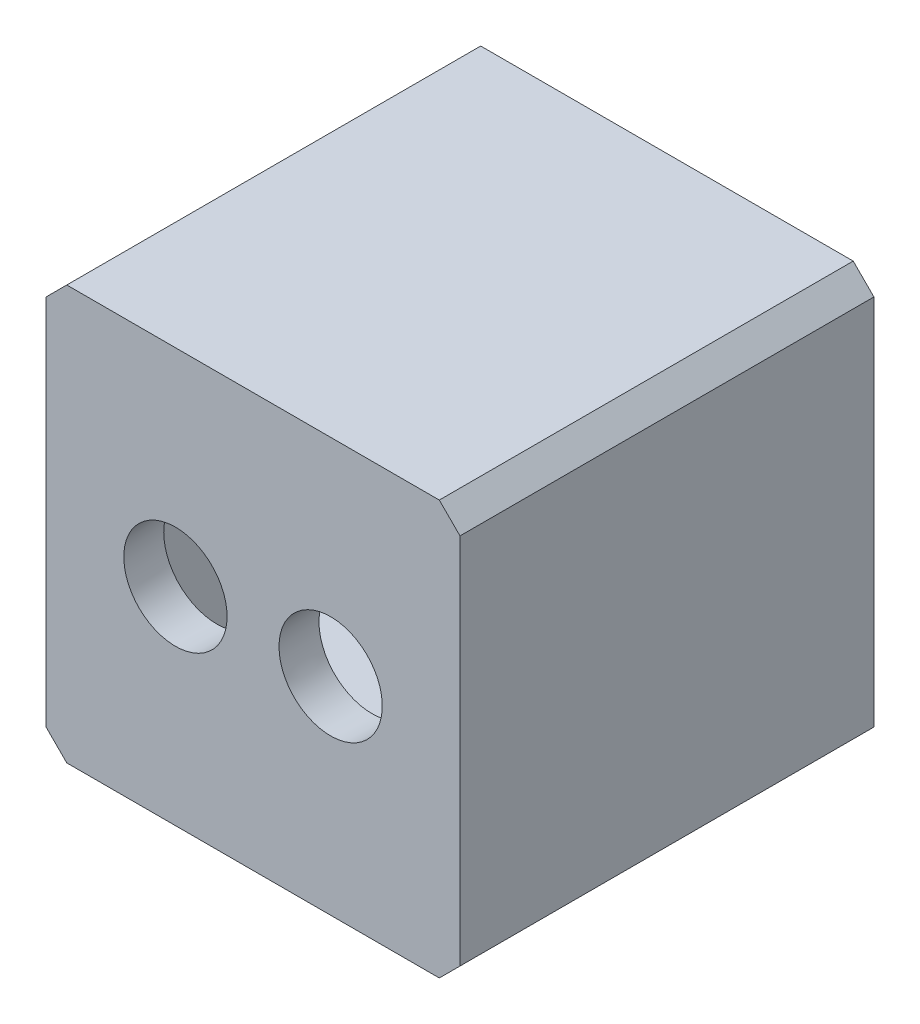
ISO-10303-21;
HEADER;
FILE_DESCRIPTION(('STEP AP214'),'2;1');
FILE_NAME('part.step','',(''),(''),'','','');
FILE_SCHEMA(('AUTOMOTIVE_DESIGN { 1 0 10303 214 1 1 1 1 }'));
ENDSEC;
DATA;
#1=APPLICATION_CONTEXT('core data for automotive mechanical design processes');
#2=APPLICATION_PROTOCOL_DEFINITION('international standard','automotive_design',2000,#1);
#3=PRODUCT_CONTEXT('',#1,'mechanical');
#4=PRODUCT('Part','Part','',(#3));
#5=PRODUCT_RELATED_PRODUCT_CATEGORY('part','',(#4));
#6=PRODUCT_DEFINITION_FORMATION('','',#4);
#7=PRODUCT_DEFINITION_CONTEXT('part definition',#1,'design');
#8=PRODUCT_DEFINITION('design','',#6,#7);
#9=PRODUCT_DEFINITION_SHAPE('','',#8);
#10=(LENGTH_UNIT() NAMED_UNIT(*) SI_UNIT(.MILLI.,.METRE.));
#11=(NAMED_UNIT(*) PLANE_ANGLE_UNIT() SI_UNIT($,.RADIAN.));
#12=(NAMED_UNIT(*) SI_UNIT($,.STERADIAN.) SOLID_ANGLE_UNIT());
#13=UNCERTAINTY_MEASURE_WITH_UNIT(LENGTH_MEASURE(1.E-05),#10,'distance_accuracy_value','');
#14=(GEOMETRIC_REPRESENTATION_CONTEXT(3) GLOBAL_UNCERTAINTY_ASSIGNED_CONTEXT((#13)) GLOBAL_UNIT_ASSIGNED_CONTEXT((#10,
#11,#12)) REPRESENTATION_CONTEXT('',''));
#15=CARTESIAN_POINT('',(0.,0.,0.));
#16=DIRECTION('',(0.,0.,1.));
#17=DIRECTION('',(1.,0.,0.));
#18=AXIS2_PLACEMENT_3D('',#15,#16,#17);
#19=CARTESIAN_POINT('',(-20.8804102547524,19.1826555023924,17.));
#20=DIRECTION('',(0.,0.,-1.));
#21=DIRECTION('',(-1.,0.,0.));
#22=AXIS2_PLACEMENT_3D('',#19,#20,#21);
#23=CONICAL_SURFACE('',#22,2.6,0.0349065850398866);
#24=CARTESIAN_POINT('',(-20.8804102547524,19.1826555023924,20.));
#25=DIRECTION('',(0.,0.,-1.));
#26=DIRECTION('',(-1.,0.,0.));
#27=AXIS2_PLACEMENT_3D('',#24,#25,#26);
#28=CIRCLE('',#27,2.49523769152476);
#29=CARTESIAN_POINT('',(-23.3756479462771,19.1826555023924,20.));
#30=VERTEX_POINT('',#29);
#31=EDGE_CURVE('E173',#30,#30,#28,.F.);
#32=ORIENTED_EDGE('',*,*,#31,.T.);
#33=EDGE_LOOP('',(#32));
#34=FACE_BOUND('',#33,.T.);
#35=CARTESIAN_POINT('',(-20.8804102547524,19.1826555023924,18.));
#36=DIRECTION('',(0.,0.,-1.));
#37=DIRECTION('',(-1.,0.,0.));
#38=AXIS2_PLACEMENT_3D('',#35,#36,#37);
#39=CIRCLE('',#38,2.56507923050826);
#40=CARTESIAN_POINT('',(-23.4454894852606,19.1826555023924,18.));
#41=VERTEX_POINT('',#40);
#42=EDGE_CURVE('E170',#41,#41,#39,.T.);
#43=ORIENTED_EDGE('',*,*,#42,.T.);
#44=EDGE_LOOP('',(#43));
#45=FACE_BOUND('',#44,.T.);
#46=ADVANCED_FACE('F35',(#34,#45),#23,.F.);
#47=CARTESIAN_POINT('',(-28.3804102547524,19.1826555023924,17.));
#48=DIRECTION('',(0.,0.,-1.));
#49=DIRECTION('',(1.,0.,0.));
#50=AXIS2_PLACEMENT_3D('',#47,#48,#49);
#51=CONICAL_SURFACE('',#50,2.6,0.0349065850398866);
#52=CARTESIAN_POINT('',(-28.3804102547524,19.1826555023924,20.));
#53=DIRECTION('',(0.,0.,1.));
#54=DIRECTION('',(1.,0.,0.));
#55=AXIS2_PLACEMENT_3D('',#52,#53,#54);
#56=CIRCLE('',#55,2.49523769152476);
#57=CARTESIAN_POINT('',(-25.8851725632276,19.1826555023924,20.));
#58=VERTEX_POINT('',#57);
#59=EDGE_CURVE('E174',#58,#58,#56,.T.);
#60=ORIENTED_EDGE('',*,*,#59,.T.);
#61=EDGE_LOOP('',(#60));
#62=FACE_BOUND('',#61,.T.);
#63=CARTESIAN_POINT('',(-28.3804102547524,19.1826555023924,18.));
#64=DIRECTION('',(0.,0.,-1.));
#65=DIRECTION('',(-1.,0.,0.));
#66=AXIS2_PLACEMENT_3D('',#63,#64,#65);
#67=CIRCLE('',#66,2.56507923050825);
#68=CARTESIAN_POINT('',(-30.9454894852606,19.1826555023924,18.));
#69=VERTEX_POINT('',#68);
#70=EDGE_CURVE('E166',#69,#69,#67,.T.);
#71=ORIENTED_EDGE('',*,*,#70,.T.);
#72=EDGE_LOOP('',(#71));
#73=FACE_BOUND('',#72,.T.);
#74=ADVANCED_FACE('F272',(#62,#73),#51,.F.);
#75=CARTESIAN_POINT('',(-34.6304102547524,29.1826555023924,20.));
#76=DIRECTION('',(1.,0.,0.));
#77=DIRECTION('',(0.,1.,0.));
#78=AXIS2_PLACEMENT_3D('',#75,#76,#77);
#79=PLANE('',#78);
#80=DIRECTION('',(0.,-1.,0.));
#81=VECTOR('',#80,1.);
#82=CARTESIAN_POINT('',(-34.6304102547524,29.1826555023924,20.));
#83=LINE('',#82,#81);
#84=CARTESIAN_POINT('',(-34.6304102547524,28.1826555023924,20.));
#85=VERTEX_POINT('',#84);
#86=CARTESIAN_POINT('',(-34.6304102547524,10.1826555023923,20.));
#87=VERTEX_POINT('',#86);
#88=EDGE_CURVE('E180',#85,#87,#83,.T.);
#89=ORIENTED_EDGE('',*,*,#88,.F.);
#90=DIRECTION('',(0.,0.,-1.));
#91=VECTOR('',#90,1.);
#92=CARTESIAN_POINT('',(-34.6304102547524,28.1826555023924,20.));
#93=LINE('',#92,#91);
#94=CARTESIAN_POINT('',(-34.6304102547524,28.1826555023924,0.));
#95=VERTEX_POINT('',#94);
#96=EDGE_CURVE('E11',#85,#95,#93,.T.);
#97=ORIENTED_EDGE('',*,*,#96,.T.);
#98=DIRECTION('',(0.,-1.,0.));
#99=VECTOR('',#98,1.);
#100=CARTESIAN_POINT('',(-34.6304102547524,29.1826555023924,0.));
#101=LINE('',#100,#99);
#102=CARTESIAN_POINT('',(-34.6304102547524,10.1826555023923,0.));
#103=VERTEX_POINT('',#102);
#104=EDGE_CURVE('E177',#95,#103,#101,.T.);
#105=ORIENTED_EDGE('',*,*,#104,.T.);
#106=DIRECTION('',(0.,0.,1.));
#107=VECTOR('',#106,1.);
#108=CARTESIAN_POINT('',(-34.6304102547524,10.1826555023923,20.));
#109=LINE('',#108,#107);
#110=EDGE_CURVE('E44',#103,#87,#109,.T.);
#111=ORIENTED_EDGE('',*,*,#110,.T.);
#112=EDGE_LOOP('',(#89,#97,#105,#111));
#113=FACE_BOUND('',#112,.T.);
#114=ADVANCED_FACE('F233',(#113),#79,.F.);
#115=CARTESIAN_POINT('',(-34.6304102547524,9.18265550239235,20.));
#116=DIRECTION('',(0.,1.,0.));
#117=DIRECTION('',(-1.,0.,0.));
#118=AXIS2_PLACEMENT_3D('',#115,#116,#117);
#119=PLANE('',#118);
#120=DIRECTION('',(1.,0.,0.));
#121=VECTOR('',#120,1.);
#122=CARTESIAN_POINT('',(-34.6304102547524,9.18265550239235,0.));
#123=LINE('',#122,#121);
#124=CARTESIAN_POINT('',(-33.6304102547524,9.18265550239235,0.));
#125=VERTEX_POINT('',#124);
#126=CARTESIAN_POINT('',(-15.6304102547524,9.18265550239235,0.));
#127=VERTEX_POINT('',#126);
#128=EDGE_CURVE('E194',#125,#127,#123,.T.);
#129=ORIENTED_EDGE('',*,*,#128,.T.);
#130=DIRECTION('',(0.,0.,1.));
#131=VECTOR('',#130,1.);
#132=CARTESIAN_POINT('',(-15.6304102547524,9.18265550239235,20.));
#133=LINE('',#132,#131);
#134=CARTESIAN_POINT('',(-15.6304102547524,9.18265550239235,20.));
#135=VERTEX_POINT('',#134);
#136=EDGE_CURVE('E218',#127,#135,#133,.T.);
#137=ORIENTED_EDGE('',*,*,#136,.T.);
#138=DIRECTION('',(1.,0.,0.));
#139=VECTOR('',#138,1.);
#140=CARTESIAN_POINT('',(-34.6304102547524,9.18265550239235,20.));
#141=LINE('',#140,#139);
#142=CARTESIAN_POINT('',(-33.6304102547524,9.18265550239235,20.));
#143=VERTEX_POINT('',#142);
#144=EDGE_CURVE('E183',#143,#135,#141,.T.);
#145=ORIENTED_EDGE('',*,*,#144,.F.);
#146=DIRECTION('',(0.,0.,-1.));
#147=VECTOR('',#146,1.);
#148=CARTESIAN_POINT('',(-33.6304102547524,9.18265550239235,20.));
#149=LINE('',#148,#147);
#150=EDGE_CURVE('E215',#143,#125,#149,.T.);
#151=ORIENTED_EDGE('',*,*,#150,.T.);
#152=EDGE_LOOP('',(#129,#137,#145,#151));
#153=FACE_BOUND('',#152,.T.);
#154=ADVANCED_FACE('F244',(#153),#119,.F.);
#155=CARTESIAN_POINT('',(-14.6304102547524,29.1826555023924,20.));
#156=DIRECTION('',(-1.,0.,0.));
#157=DIRECTION('',(0.,-1.,0.));
#158=AXIS2_PLACEMENT_3D('',#155,#156,#157);
#159=PLANE('',#158);
#160=DIRECTION('',(0.,1.,0.));
#161=VECTOR('',#160,1.);
#162=CARTESIAN_POINT('',(-14.6304102547524,29.1826555023924,20.));
#163=LINE('',#162,#161);
#164=CARTESIAN_POINT('',(-14.6304102547524,10.1826555023924,20.));
#165=VERTEX_POINT('',#164);
#166=CARTESIAN_POINT('',(-14.6304102547524,28.1826555023923,20.));
#167=VERTEX_POINT('',#166);
#168=EDGE_CURVE('E187',#165,#167,#163,.T.);
#169=ORIENTED_EDGE('',*,*,#168,.F.);
#170=DIRECTION('',(0.,0.,-1.));
#171=VECTOR('',#170,1.);
#172=CARTESIAN_POINT('',(-14.6304102547524,10.1826555023924,20.));
#173=LINE('',#172,#171);
#174=CARTESIAN_POINT('',(-14.6304102547524,10.1826555023924,0.));
#175=VERTEX_POINT('',#174);
#176=EDGE_CURVE('E204',#165,#175,#173,.T.);
#177=ORIENTED_EDGE('',*,*,#176,.T.);
#178=DIRECTION('',(0.,1.,0.));
#179=VECTOR('',#178,1.);
#180=CARTESIAN_POINT('',(-14.6304102547524,29.1826555023924,0.));
#181=LINE('',#180,#179);
#182=CARTESIAN_POINT('',(-14.6304102547524,28.1826555023923,0.));
#183=VERTEX_POINT('',#182);
#184=EDGE_CURVE('E197',#175,#183,#181,.T.);
#185=ORIENTED_EDGE('',*,*,#184,.T.);
#186=DIRECTION('',(0.,0.,1.));
#187=VECTOR('',#186,1.);
#188=CARTESIAN_POINT('',(-14.6304102547524,28.1826555023923,20.));
#189=LINE('',#188,#187);
#190=EDGE_CURVE('E191',#183,#167,#189,.T.);
#191=ORIENTED_EDGE('',*,*,#190,.T.);
#192=EDGE_LOOP('',(#169,#177,#185,#191));
#193=FACE_BOUND('',#192,.T.);
#194=ADVANCED_FACE('F255',(#193),#159,.F.);
#195=CARTESIAN_POINT('',(-34.6304102547524,29.1826555023924,20.));
#196=DIRECTION('',(0.,-1.,0.));
#197=DIRECTION('',(0.,0.,-1.));
#198=AXIS2_PLACEMENT_3D('',#195,#196,#197);
#199=PLANE('',#198);
#200=DIRECTION('',(-1.,0.,0.));
#201=VECTOR('',#200,1.);
#202=CARTESIAN_POINT('',(-34.6304102547524,29.1826555023924,20.));
#203=LINE('',#202,#201);
#204=CARTESIAN_POINT('',(-15.6304102547524,29.1826555023924,20.));
#205=VERTEX_POINT('',#204);
#206=CARTESIAN_POINT('',(-33.6304102547524,29.1826555023924,20.));
#207=VERTEX_POINT('',#206);
#208=EDGE_CURVE('E189',#205,#207,#203,.T.);
#209=ORIENTED_EDGE('',*,*,#208,.F.);
#210=DIRECTION('',(0.,0.,-1.));
#211=VECTOR('',#210,1.);
#212=CARTESIAN_POINT('',(-15.6304102547524,29.1826555023924,20.));
#213=LINE('',#212,#211);
#214=CARTESIAN_POINT('',(-15.6304102547524,29.1826555023924,0.));
#215=VERTEX_POINT('',#214);
#216=EDGE_CURVE('E228',#205,#215,#213,.T.);
#217=ORIENTED_EDGE('',*,*,#216,.T.);
#218=DIRECTION('',(-1.,0.,0.));
#219=VECTOR('',#218,1.);
#220=CARTESIAN_POINT('',(-34.6304102547524,29.1826555023924,0.));
#221=LINE('',#220,#219);
#222=CARTESIAN_POINT('',(-33.6304102547524,29.1826555023924,0.));
#223=VERTEX_POINT('',#222);
#224=EDGE_CURVE('E184',#215,#223,#221,.T.);
#225=ORIENTED_EDGE('',*,*,#224,.T.);
#226=DIRECTION('',(0.,0.,1.));
#227=VECTOR('',#226,1.);
#228=CARTESIAN_POINT('',(-33.6304102547524,29.1826555023924,20.));
#229=LINE('',#228,#227);
#230=EDGE_CURVE('E51',#223,#207,#229,.T.);
#231=ORIENTED_EDGE('',*,*,#230,.T.);
#232=EDGE_LOOP('',(#209,#217,#225,#231));
#233=FACE_BOUND('',#232,.T.);
#234=ADVANCED_FACE('F261',(#233),#199,.F.);
#235=CARTESIAN_POINT('',(0.,0.,20.));
#236=DIRECTION('',(0.,0.,1.));
#237=DIRECTION('',(1.,0.,0.));
#238=AXIS2_PLACEMENT_3D('',#235,#236,#237);
#239=PLANE('',#238);
#240=ORIENTED_EDGE('',*,*,#59,.F.);
#241=EDGE_LOOP('',(#240));
#242=FACE_BOUND('',#241,.T.);
#243=ORIENTED_EDGE('',*,*,#31,.F.);
#244=EDGE_LOOP('',(#243));
#245=FACE_BOUND('',#244,.T.);
#246=ORIENTED_EDGE('',*,*,#144,.T.);
#247=DIRECTION('',(-0.707106781186549,-0.707106781186546,0.));
#248=VECTOR('',#247,1.);
#249=CARTESIAN_POINT('',(-12.4065328785723,12.4065328785724,20.));
#250=LINE('',#249,#248);
#251=EDGE_CURVE('E225',#135,#165,#250,.F.);
#252=ORIENTED_EDGE('',*,*,#251,.T.);
#253=ORIENTED_EDGE('',*,*,#168,.T.);
#254=DIRECTION('',(0.707106781186546,-0.707106781186549,0.));
#255=VECTOR('',#254,1.);
#256=CARTESIAN_POINT('',(6.77612262381995,6.77612262381993,20.));
#257=LINE('',#256,#255);
#258=EDGE_CURVE('E58',#167,#205,#257,.F.);
#259=ORIENTED_EDGE('',*,*,#258,.T.);
#260=ORIENTED_EDGE('',*,*,#208,.T.);
#261=DIRECTION('',(0.707106781186549,0.707106781186546,0.));
#262=VECTOR('',#261,1.);
#263=CARTESIAN_POINT('',(-31.4065328785723,31.4065328785724,20.));
#264=LINE('',#263,#262);
#265=EDGE_CURVE('E222',#207,#85,#264,.F.);
#266=ORIENTED_EDGE('',*,*,#265,.T.);
#267=ORIENTED_EDGE('',*,*,#88,.T.);
#268=DIRECTION('',(-0.707106781186548,0.707106781186548,0.));
#269=VECTOR('',#268,1.);
#270=CARTESIAN_POINT('',(-12.22387737618,-12.22387737618,20.));
#271=LINE('',#270,#269);
#272=EDGE_CURVE('E220',#87,#143,#271,.F.);
#273=ORIENTED_EDGE('',*,*,#272,.T.);
#274=EDGE_LOOP('',(#246,#252,#253,#259,#260,#266,#267,#273));
#275=FACE_BOUND('',#274,.T.);
#276=ADVANCED_FACE('F238',(#242,#245,#275),#239,.T.);
#277=CARTESIAN_POINT('',(0.,0.,0.));
#278=DIRECTION('',(0.,0.,1.));
#279=DIRECTION('',(1.,0.,0.));
#280=AXIS2_PLACEMENT_3D('',#277,#278,#279);
#281=PLANE('',#280);
#282=DIRECTION('',(-1.,0.,0.));
#283=VECTOR('',#282,1.);
#284=CARTESIAN_POINT('',(-16.6304102547524,11.1826555023924,0.));
#285=LINE('',#284,#283);
#286=CARTESIAN_POINT('',(-16.6304102547524,11.1826555023924,0.));
#287=VERTEX_POINT('',#286);
#288=CARTESIAN_POINT('',(-32.6304102547524,11.1826555023924,0.));
#289=VERTEX_POINT('',#288);
#290=EDGE_CURVE('E160',#287,#289,#285,.T.);
#291=ORIENTED_EDGE('',*,*,#290,.F.);
#292=DIRECTION('',(0.,-1.,0.));
#293=VECTOR('',#292,1.);
#294=CARTESIAN_POINT('',(-16.6304102547524,27.1826555023924,0.));
#295=LINE('',#294,#293);
#296=CARTESIAN_POINT('',(-16.6304102547524,27.1826555023924,0.));
#297=VERTEX_POINT('',#296);
#298=EDGE_CURVE('E134',#297,#287,#295,.T.);
#299=ORIENTED_EDGE('',*,*,#298,.F.);
#300=DIRECTION('',(1.,0.,0.));
#301=VECTOR('',#300,1.);
#302=CARTESIAN_POINT('',(-16.6304102547524,27.1826555023924,0.));
#303=LINE('',#302,#301);
#304=CARTESIAN_POINT('',(-32.6304102547524,27.1826555023924,0.));
#305=VERTEX_POINT('',#304);
#306=EDGE_CURVE('E151',#305,#297,#303,.T.);
#307=ORIENTED_EDGE('',*,*,#306,.F.);
#308=DIRECTION('',(0.,1.,0.));
#309=VECTOR('',#308,1.);
#310=CARTESIAN_POINT('',(-32.6304102547524,27.1826555023924,0.));
#311=LINE('',#310,#309);
#312=EDGE_CURVE('E154',#289,#305,#311,.T.);
#313=ORIENTED_EDGE('',*,*,#312,.F.);
#314=EDGE_LOOP('',(#291,#299,#307,#313));
#315=FACE_BOUND('',#314,.T.);
#316=ORIENTED_EDGE('',*,*,#184,.F.);
#317=DIRECTION('',(0.707106781186549,0.707106781186546,0.));
#318=VECTOR('',#317,1.);
#319=CARTESIAN_POINT('',(-14.6304102547524,10.1826555023924,0.));
#320=LINE('',#319,#318);
#321=EDGE_CURVE('E213',#175,#127,#320,.F.);
#322=ORIENTED_EDGE('',*,*,#321,.T.);
#323=ORIENTED_EDGE('',*,*,#128,.F.);
#324=DIRECTION('',(0.707106781186548,-0.707106781186548,0.));
#325=VECTOR('',#324,1.);
#326=CARTESIAN_POINT('',(-33.6304102547524,9.18265550239235,0.));
#327=LINE('',#326,#325);
#328=EDGE_CURVE('E207',#125,#103,#327,.F.);
#329=ORIENTED_EDGE('',*,*,#328,.T.);
#330=ORIENTED_EDGE('',*,*,#104,.F.);
#331=DIRECTION('',(-0.707106781186549,-0.707106781186546,0.));
#332=VECTOR('',#331,1.);
#333=CARTESIAN_POINT('',(-34.6304102547524,28.1826555023924,0.));
#334=LINE('',#333,#332);
#335=EDGE_CURVE('E209',#95,#223,#334,.F.);
#336=ORIENTED_EDGE('',*,*,#335,.T.);
#337=ORIENTED_EDGE('',*,*,#224,.F.);
#338=DIRECTION('',(-0.707106781186546,0.707106781186549,0.));
#339=VECTOR('',#338,1.);
#340=CARTESIAN_POINT('',(-15.6304102547524,29.1826555023924,0.));
#341=LINE('',#340,#339);
#342=EDGE_CURVE('E211',#215,#183,#341,.F.);
#343=ORIENTED_EDGE('',*,*,#342,.T.);
#344=EDGE_LOOP('',(#316,#322,#323,#329,#330,#336,#337,#343));
#345=FACE_BOUND('',#344,.T.);
#346=ADVANCED_FACE('F248',(#315,#345),#281,.F.);
#347=CARTESIAN_POINT('',(-16.6304102547524,27.1826555023924,18.));
#348=DIRECTION('',(1.,0.,0.));
#349=DIRECTION('',(0.,1.,0.));
#350=AXIS2_PLACEMENT_3D('',#347,#348,#349);
#351=PLANE('',#350);
#352=ORIENTED_EDGE('',*,*,#298,.T.);
#353=DIRECTION('',(0.,0.,-1.));
#354=VECTOR('',#353,1.);
#355=CARTESIAN_POINT('',(-16.6304102547524,11.1826555023924,18.));
#356=LINE('',#355,#354);
#357=CARTESIAN_POINT('',(-16.6304102547524,11.1826555023924,18.));
#358=VERTEX_POINT('',#357);
#359=EDGE_CURVE('E127',#358,#287,#356,.T.);
#360=ORIENTED_EDGE('',*,*,#359,.F.);
#361=DIRECTION('',(0.,-1.,0.));
#362=VECTOR('',#361,1.);
#363=CARTESIAN_POINT('',(-16.6304102547524,27.1826555023924,18.));
#364=LINE('',#363,#362);
#365=CARTESIAN_POINT('',(-16.6304102547524,27.1826555023924,18.));
#366=VERTEX_POINT('',#365);
#367=EDGE_CURVE('E131',#366,#358,#364,.T.);
#368=ORIENTED_EDGE('',*,*,#367,.F.);
#369=DIRECTION('',(0.,0.,-1.));
#370=VECTOR('',#369,1.);
#371=CARTESIAN_POINT('',(-16.6304102547524,27.1826555023924,18.));
#372=LINE('',#371,#370);
#373=EDGE_CURVE('E164',#366,#297,#372,.T.);
#374=ORIENTED_EDGE('',*,*,#373,.T.);
#375=EDGE_LOOP('',(#352,#360,#368,#374));
#376=FACE_BOUND('',#375,.T.);
#377=ADVANCED_FACE('F129',(#376),#351,.F.);
#378=CARTESIAN_POINT('',(-16.6304102547524,27.1826555023924,18.));
#379=DIRECTION('',(0.,1.,0.));
#380=DIRECTION('',(0.,0.,1.));
#381=AXIS2_PLACEMENT_3D('',#378,#379,#380);
#382=PLANE('',#381);
#383=ORIENTED_EDGE('',*,*,#306,.T.);
#384=ORIENTED_EDGE('',*,*,#373,.F.);
#385=DIRECTION('',(1.,0.,0.));
#386=VECTOR('',#385,1.);
#387=CARTESIAN_POINT('',(-16.6304102547524,27.1826555023924,18.));
#388=LINE('',#387,#386);
#389=CARTESIAN_POINT('',(-32.6304102547524,27.1826555023924,18.));
#390=VERTEX_POINT('',#389);
#391=EDGE_CURVE('E139',#390,#366,#388,.T.);
#392=ORIENTED_EDGE('',*,*,#391,.F.);
#393=DIRECTION('',(0.,0.,-1.));
#394=VECTOR('',#393,1.);
#395=CARTESIAN_POINT('',(-32.6304102547524,27.1826555023924,18.));
#396=LINE('',#395,#394);
#397=EDGE_CURVE('E167',#390,#305,#396,.T.);
#398=ORIENTED_EDGE('',*,*,#397,.T.);
#399=EDGE_LOOP('',(#383,#384,#392,#398));
#400=FACE_BOUND('',#399,.T.);
#401=ADVANCED_FACE('F321',(#400),#382,.F.);
#402=CARTESIAN_POINT('',(-32.6304102547524,27.1826555023924,18.));
#403=DIRECTION('',(-1.,0.,0.));
#404=DIRECTION('',(0.,0.,1.));
#405=AXIS2_PLACEMENT_3D('',#402,#403,#404);
#406=PLANE('',#405);
#407=ORIENTED_EDGE('',*,*,#312,.T.);
#408=ORIENTED_EDGE('',*,*,#397,.F.);
#409=DIRECTION('',(0.,1.,0.));
#410=VECTOR('',#409,1.);
#411=CARTESIAN_POINT('',(-32.6304102547524,27.1826555023924,18.));
#412=LINE('',#411,#410);
#413=CARTESIAN_POINT('',(-32.6304102547524,11.1826555023924,18.));
#414=VERTEX_POINT('',#413);
#415=EDGE_CURVE('E147',#414,#390,#412,.T.);
#416=ORIENTED_EDGE('',*,*,#415,.F.);
#417=DIRECTION('',(0.,0.,-1.));
#418=VECTOR('',#417,1.);
#419=CARTESIAN_POINT('',(-32.6304102547524,11.1826555023924,18.));
#420=LINE('',#419,#418);
#421=EDGE_CURVE('E138',#414,#289,#420,.T.);
#422=ORIENTED_EDGE('',*,*,#421,.T.);
#423=EDGE_LOOP('',(#407,#408,#416,#422));
#424=FACE_BOUND('',#423,.T.);
#425=ADVANCED_FACE('F316',(#424),#406,.F.);
#426=CARTESIAN_POINT('',(-16.6304102547524,11.1826555023924,18.));
#427=DIRECTION('',(0.,-1.,0.));
#428=DIRECTION('',(1.,0.,0.));
#429=AXIS2_PLACEMENT_3D('',#426,#427,#428);
#430=PLANE('',#429);
#431=ORIENTED_EDGE('',*,*,#290,.T.);
#432=ORIENTED_EDGE('',*,*,#421,.F.);
#433=DIRECTION('',(-1.,0.,0.));
#434=VECTOR('',#433,1.);
#435=CARTESIAN_POINT('',(-16.6304102547524,11.1826555023924,18.));
#436=LINE('',#435,#434);
#437=EDGE_CURVE('E142',#358,#414,#436,.T.);
#438=ORIENTED_EDGE('',*,*,#437,.F.);
#439=ORIENTED_EDGE('',*,*,#359,.T.);
#440=EDGE_LOOP('',(#431,#432,#438,#439));
#441=FACE_BOUND('',#440,.T.);
#442=ADVANCED_FACE('F143',(#441),#430,.F.);
#443=CARTESIAN_POINT('',(0.,0.,18.));
#444=DIRECTION('',(0.,0.,-1.));
#445=DIRECTION('',(-1.,0.,0.));
#446=AXIS2_PLACEMENT_3D('',#443,#444,#445);
#447=PLANE('',#446);
#448=ORIENTED_EDGE('',*,*,#42,.F.);
#449=EDGE_LOOP('',(#448));
#450=FACE_BOUND('',#449,.T.);
#451=ORIENTED_EDGE('',*,*,#70,.F.);
#452=EDGE_LOOP('',(#451));
#453=FACE_BOUND('',#452,.T.);
#454=ORIENTED_EDGE('',*,*,#367,.T.);
#455=ORIENTED_EDGE('',*,*,#437,.T.);
#456=ORIENTED_EDGE('',*,*,#415,.T.);
#457=ORIENTED_EDGE('',*,*,#391,.T.);
#458=EDGE_LOOP('',(#454,#455,#456,#457));
#459=FACE_BOUND('',#458,.T.);
#460=ADVANCED_FACE('F149',(#450,#453,#459),#447,.T.);
#461=CARTESIAN_POINT('',(-14.6304102547524,10.1826555023924,20.));
#462=DIRECTION('',(-0.707106781186546,0.707106781186549,0.));
#463=DIRECTION('',(0.,0.,-1.));
#464=AXIS2_PLACEMENT_3D('',#461,#462,#463);
#465=PLANE('',#464);
#466=ORIENTED_EDGE('',*,*,#251,.F.);
#467=ORIENTED_EDGE('',*,*,#136,.F.);
#468=ORIENTED_EDGE('',*,*,#321,.F.);
#469=ORIENTED_EDGE('',*,*,#176,.F.);
#470=EDGE_LOOP('',(#466,#467,#468,#469));
#471=FACE_BOUND('',#470,.T.);
#472=ADVANCED_FACE('F252',(#471),#465,.F.);
#473=CARTESIAN_POINT('',(-15.6304102547524,29.1826555023924,20.));
#474=DIRECTION('',(-0.707106781186549,-0.707106781186546,0.));
#475=DIRECTION('',(0.,0.,-1.));
#476=AXIS2_PLACEMENT_3D('',#473,#474,#475);
#477=PLANE('',#476);
#478=ORIENTED_EDGE('',*,*,#258,.F.);
#479=ORIENTED_EDGE('',*,*,#190,.F.);
#480=ORIENTED_EDGE('',*,*,#342,.F.);
#481=ORIENTED_EDGE('',*,*,#216,.F.);
#482=EDGE_LOOP('',(#478,#479,#480,#481));
#483=FACE_BOUND('',#482,.T.);
#484=ADVANCED_FACE('F259',(#483),#477,.F.);
#485=CARTESIAN_POINT('',(-34.6304102547524,28.1826555023924,20.));
#486=DIRECTION('',(0.707106781186546,-0.707106781186549,0.));
#487=DIRECTION('',(0.,0.,-1.));
#488=AXIS2_PLACEMENT_3D('',#485,#486,#487);
#489=PLANE('',#488);
#490=ORIENTED_EDGE('',*,*,#265,.F.);
#491=ORIENTED_EDGE('',*,*,#230,.F.);
#492=ORIENTED_EDGE('',*,*,#335,.F.);
#493=ORIENTED_EDGE('',*,*,#96,.F.);
#494=EDGE_LOOP('',(#490,#491,#492,#493));
#495=FACE_BOUND('',#494,.T.);
#496=ADVANCED_FACE('F263',(#495),#489,.F.);
#497=CARTESIAN_POINT('',(-33.6304102547524,9.18265550239235,20.));
#498=DIRECTION('',(0.707106781186547,0.707106781186547,0.));
#499=DIRECTION('',(0.,0.,-1.));
#500=AXIS2_PLACEMENT_3D('',#497,#498,#499);
#501=PLANE('',#500);
#502=ORIENTED_EDGE('',*,*,#272,.F.);
#503=ORIENTED_EDGE('',*,*,#110,.F.);
#504=ORIENTED_EDGE('',*,*,#328,.F.);
#505=ORIENTED_EDGE('',*,*,#150,.F.);
#506=EDGE_LOOP('',(#502,#503,#504,#505));
#507=FACE_BOUND('',#506,.T.);
#508=ADVANCED_FACE('F38',(#507),#501,.F.);
#509=CLOSED_SHELL('',(#46,#74,#114,#154,#194,#234,#276,#346,#377,#401,#425,#442,#460,#472,#484,
#496,#508));
#510=MANIFOLD_SOLID_BREP('B2',#509);
#511=ADVANCED_BREP_SHAPE_REPRESENTATION('',(#18,#510),#14);
#512=SHAPE_DEFINITION_REPRESENTATION(#9,#511);
ENDSEC;
END-ISO-10303-21;
